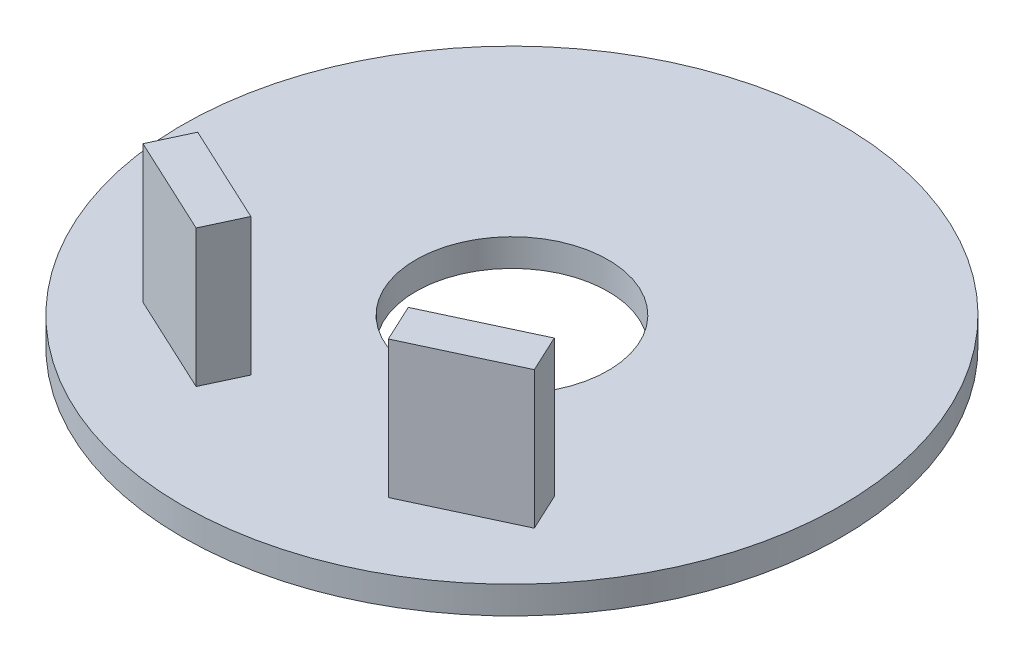
ISO-10303-21;
HEADER;
FILE_DESCRIPTION(('STEP AP214'),'2;1');
FILE_NAME('part.step','',(''),(''),'','','');
FILE_SCHEMA(('AUTOMOTIVE_DESIGN { 1 0 10303 214 1 1 1 1 }'));
ENDSEC;
DATA;
#1=APPLICATION_CONTEXT('core data for automotive mechanical design processes');
#2=APPLICATION_PROTOCOL_DEFINITION('international standard','automotive_design',2000,#1);
#3=PRODUCT_CONTEXT('',#1,'mechanical');
#4=PRODUCT('Part','Part','',(#3));
#5=PRODUCT_RELATED_PRODUCT_CATEGORY('part','',(#4));
#6=PRODUCT_DEFINITION_FORMATION('','',#4);
#7=PRODUCT_DEFINITION_CONTEXT('part definition',#1,'design');
#8=PRODUCT_DEFINITION('design','',#6,#7);
#9=PRODUCT_DEFINITION_SHAPE('','',#8);
#10=(LENGTH_UNIT() NAMED_UNIT(*) SI_UNIT(.MILLI.,.METRE.));
#11=(NAMED_UNIT(*) PLANE_ANGLE_UNIT() SI_UNIT($,.RADIAN.));
#12=(NAMED_UNIT(*) SI_UNIT($,.STERADIAN.) SOLID_ANGLE_UNIT());
#13=UNCERTAINTY_MEASURE_WITH_UNIT(LENGTH_MEASURE(1.E-05),#10,'distance_accuracy_value','');
#14=(GEOMETRIC_REPRESENTATION_CONTEXT(3) GLOBAL_UNCERTAINTY_ASSIGNED_CONTEXT((#13)) GLOBAL_UNIT_ASSIGNED_CONTEXT((#10,
#11,#12)) REPRESENTATION_CONTEXT('',''));
#15=CARTESIAN_POINT('',(0.,0.,0.));
#16=DIRECTION('',(0.,0.,1.));
#17=DIRECTION('',(1.,0.,0.));
#18=AXIS2_PLACEMENT_3D('',#15,#16,#17);
#19=CARTESIAN_POINT('',(0.,0.5,0.));
#20=DIRECTION('',(0.,1.,0.));
#21=DIRECTION('',(0.,0.,1.));
#22=AXIS2_PLACEMENT_3D('',#19,#20,#21);
#23=PLANE('',#22);
#24=CARTESIAN_POINT('',(0.,0.5,0.));
#25=DIRECTION('',(0.,1.,0.));
#26=DIRECTION('',(0.,0.,1.));
#27=AXIS2_PLACEMENT_3D('',#24,#25,#26);
#28=CIRCLE('',#27,12.);
#29=CARTESIAN_POINT('',(0.,0.5,12.));
#30=VERTEX_POINT('',#29);
#31=EDGE_CURVE('E11',#30,#30,#28,.T.);
#32=ORIENTED_EDGE('',*,*,#31,.T.);
#33=EDGE_LOOP('',(#32));
#34=FACE_BOUND('',#33,.T.);
#35=CARTESIAN_POINT('',(0.,0.5,0.));
#36=DIRECTION('',(0.,1.,0.));
#37=DIRECTION('',(0.,0.,1.));
#38=AXIS2_PLACEMENT_3D('',#35,#36,#37);
#39=CIRCLE('',#38,3.5);
#40=CARTESIAN_POINT('',(0.,0.5,3.5));
#41=VERTEX_POINT('',#40);
#42=EDGE_CURVE('E161',#41,#41,#39,.T.);
#43=ORIENTED_EDGE('',*,*,#42,.F.);
#44=EDGE_LOOP('',(#43));
#45=FACE_BOUND('',#44,.T.);
#46=DIRECTION('',(0.906307787036653,0.,0.422618261740693));
#47=VECTOR('',#46,1.);
#48=CARTESIAN_POINT('',(-3.5,0.5,8.));
#49=LINE('',#48,#47);
#50=CARTESIAN_POINT('',(-7.12523114814661,0.5,6.30952695303723));
#51=VERTEX_POINT('',#50);
#52=CARTESIAN_POINT('',(-3.5,0.5,8.));
#53=VERTEX_POINT('',#52);
#54=EDGE_CURVE('E132',#51,#53,#49,.T.);
#55=ORIENTED_EDGE('',*,*,#54,.F.);
#56=DIRECTION('',(-0.422618261740693,0.,0.906307787036653));
#57=VECTOR('',#56,1.);
#58=CARTESIAN_POINT('',(-7.12523114814661,0.5,6.30952695303723));
#59=LINE('',#58,#57);
#60=CARTESIAN_POINT('',(-6.49130375553557,0.5,4.95006527248225));
#61=VERTEX_POINT('',#60);
#62=EDGE_CURVE('E129',#61,#51,#59,.T.);
#63=ORIENTED_EDGE('',*,*,#62,.F.);
#64=DIRECTION('',(-0.906307787036653,0.,-0.422618261740693));
#65=VECTOR('',#64,1.);
#66=CARTESIAN_POINT('',(-6.49130375553557,0.5,4.95006527248225));
#67=LINE('',#66,#65);
#68=CARTESIAN_POINT('',(-2.86607260738896,0.5,6.64053831944502));
#69=VERTEX_POINT('',#68);
#70=EDGE_CURVE('E141',#69,#61,#67,.T.);
#71=ORIENTED_EDGE('',*,*,#70,.F.);
#72=DIRECTION('',(0.422618261740693,0.,-0.906307787036653));
#73=VECTOR('',#72,1.);
#74=CARTESIAN_POINT('',(-2.86607260738896,0.5,6.64053831944502));
#75=LINE('',#74,#73);
#76=EDGE_CURVE('E149',#53,#69,#75,.T.);
#77=ORIENTED_EDGE('',*,*,#76,.F.);
#78=EDGE_LOOP('',(#55,#63,#71,#77));
#79=FACE_BOUND('',#78,.T.);
#80=DIRECTION('',(-0.422618261740693,0.,-0.906307787036653));
#81=VECTOR('',#80,1.);
#82=CARTESIAN_POINT('',(7.12523114814661,0.5,6.30952695303723));
#83=LINE('',#82,#81);
#84=CARTESIAN_POINT('',(7.12523114814661,0.5,6.30952695303723));
#85=VERTEX_POINT('',#84);
#86=CARTESIAN_POINT('',(6.49130375553557,0.5,4.95006527248225));
#87=VERTEX_POINT('',#86);
#88=EDGE_CURVE('E198',#85,#87,#83,.T.);
#89=ORIENTED_EDGE('',*,*,#88,.F.);
#90=DIRECTION('',(0.906307787036653,0.,-0.422618261740693));
#91=VECTOR('',#90,1.);
#92=CARTESIAN_POINT('',(3.5,0.5,8.));
#93=LINE('',#92,#91);
#94=CARTESIAN_POINT('',(3.5,0.5,8.));
#95=VERTEX_POINT('',#94);
#96=EDGE_CURVE('E127',#95,#85,#93,.T.);
#97=ORIENTED_EDGE('',*,*,#96,.F.);
#98=DIRECTION('',(0.422618261740693,0.,0.906307787036653));
#99=VECTOR('',#98,1.);
#100=CARTESIAN_POINT('',(2.86607260738896,0.5,6.64053831944502));
#101=LINE('',#100,#99);
#102=CARTESIAN_POINT('',(2.86607260738896,0.5,6.64053831944502));
#103=VERTEX_POINT('',#102);
#104=EDGE_CURVE('E123',#103,#95,#101,.T.);
#105=ORIENTED_EDGE('',*,*,#104,.F.);
#106=DIRECTION('',(-0.906307787036653,0.,0.422618261740693));
#107=VECTOR('',#106,1.);
#108=CARTESIAN_POINT('',(6.49130375553557,0.5,4.95006527248225));
#109=LINE('',#108,#107);
#110=EDGE_CURVE('E200',#87,#103,#109,.T.);
#111=ORIENTED_EDGE('',*,*,#110,.F.);
#112=EDGE_LOOP('',(#89,#97,#105,#111));
#113=FACE_BOUND('',#112,.T.);
#114=ADVANCED_FACE('F38',(#34,#45,#79,#113),#23,.T.);
#115=CARTESIAN_POINT('',(0.,-0.5,0.));
#116=DIRECTION('',(0.,1.,0.));
#117=DIRECTION('',(0.,0.,1.));
#118=AXIS2_PLACEMENT_3D('',#115,#116,#117);
#119=PLANE('',#118);
#120=CARTESIAN_POINT('',(0.,-0.5,0.));
#121=DIRECTION('',(0.,1.,0.));
#122=DIRECTION('',(0.,0.,1.));
#123=AXIS2_PLACEMENT_3D('',#120,#121,#122);
#124=CIRCLE('',#123,12.);
#125=CARTESIAN_POINT('',(0.,-0.5,12.));
#126=VERTEX_POINT('',#125);
#127=EDGE_CURVE('E42',#126,#126,#124,.T.);
#128=ORIENTED_EDGE('',*,*,#127,.F.);
#129=EDGE_LOOP('',(#128));
#130=FACE_BOUND('',#129,.T.);
#131=CARTESIAN_POINT('',(0.,-0.5,0.));
#132=DIRECTION('',(0.,1.,0.));
#133=DIRECTION('',(0.,0.,1.));
#134=AXIS2_PLACEMENT_3D('',#131,#132,#133);
#135=CIRCLE('',#134,3.5);
#136=CARTESIAN_POINT('',(0.,-0.5,3.5));
#137=VERTEX_POINT('',#136);
#138=EDGE_CURVE('E160',#137,#137,#135,.T.);
#139=ORIENTED_EDGE('',*,*,#138,.T.);
#140=EDGE_LOOP('',(#139));
#141=FACE_BOUND('',#140,.T.);
#142=ADVANCED_FACE('F167',(#130,#141),#119,.F.);
#143=CARTESIAN_POINT('',(0.,0.5,0.));
#144=DIRECTION('',(0.,-1.,0.));
#145=DIRECTION('',(0.,0.,-1.));
#146=AXIS2_PLACEMENT_3D('',#143,#144,#145);
#147=CYLINDRICAL_SURFACE('',#146,12.);
#148=ORIENTED_EDGE('',*,*,#31,.F.);
#149=EDGE_LOOP('',(#148));
#150=FACE_BOUND('',#149,.T.);
#151=ORIENTED_EDGE('',*,*,#127,.T.);
#152=EDGE_LOOP('',(#151));
#153=FACE_BOUND('',#152,.T.);
#154=ADVANCED_FACE('F40',(#150,#153),#147,.T.);
#155=CARTESIAN_POINT('',(0.,0.5,0.));
#156=DIRECTION('',(0.,-1.,0.));
#157=DIRECTION('',(0.,0.,-1.));
#158=AXIS2_PLACEMENT_3D('',#155,#156,#157);
#159=CYLINDRICAL_SURFACE('',#158,3.5);
#160=ORIENTED_EDGE('',*,*,#42,.T.);
#161=EDGE_LOOP('',(#160));
#162=FACE_BOUND('',#161,.T.);
#163=ORIENTED_EDGE('',*,*,#138,.F.);
#164=EDGE_LOOP('',(#163));
#165=FACE_BOUND('',#164,.T.);
#166=ADVANCED_FACE('F169',(#162,#165),#159,.F.);
#167=CARTESIAN_POINT('',(-7.12523114814661,5.5,6.30952695303723));
#168=DIRECTION('',(0.906307787036653,0.,0.422618261740693));
#169=DIRECTION('',(0.422618261740693,0.,-0.906307787036653));
#170=AXIS2_PLACEMENT_3D('',#167,#168,#169);
#171=PLANE('',#170);
#172=ORIENTED_EDGE('',*,*,#62,.T.);
#173=DIRECTION('',(0.,-1.,0.));
#174=VECTOR('',#173,1.);
#175=CARTESIAN_POINT('',(-7.12523114814661,5.5,6.30952695303723));
#176=LINE('',#175,#174);
#177=CARTESIAN_POINT('',(-7.12523114814661,5.5,6.30952695303723));
#178=VERTEX_POINT('',#177);
#179=EDGE_CURVE('E158',#178,#51,#176,.T.);
#180=ORIENTED_EDGE('',*,*,#179,.F.);
#181=DIRECTION('',(-0.422618261740693,0.,0.906307787036653));
#182=VECTOR('',#181,1.);
#183=CARTESIAN_POINT('',(-7.12523114814661,5.5,6.30952695303723));
#184=LINE('',#183,#182);
#185=CARTESIAN_POINT('',(-6.49130375553557,5.5,4.95006527248225));
#186=VERTEX_POINT('',#185);
#187=EDGE_CURVE('E137',#186,#178,#184,.T.);
#188=ORIENTED_EDGE('',*,*,#187,.F.);
#189=DIRECTION('',(0.,-1.,0.));
#190=VECTOR('',#189,1.);
#191=CARTESIAN_POINT('',(-6.49130375553557,5.5,4.95006527248225));
#192=LINE('',#191,#190);
#193=EDGE_CURVE('E146',#186,#61,#192,.T.);
#194=ORIENTED_EDGE('',*,*,#193,.T.);
#195=EDGE_LOOP('',(#172,#180,#188,#194));
#196=FACE_BOUND('',#195,.T.);
#197=ADVANCED_FACE('F171',(#196),#171,.F.);
#198=CARTESIAN_POINT('',(-3.5,5.5,8.));
#199=DIRECTION('',(0.422618261740693,0.,-0.906307787036653));
#200=DIRECTION('',(-0.906307787036653,0.,-0.422618261740693));
#201=AXIS2_PLACEMENT_3D('',#198,#199,#200);
#202=PLANE('',#201);
#203=ORIENTED_EDGE('',*,*,#54,.T.);
#204=DIRECTION('',(0.,-1.,0.));
#205=VECTOR('',#204,1.);
#206=CARTESIAN_POINT('',(-3.5,5.5,8.));
#207=LINE('',#206,#205);
#208=CARTESIAN_POINT('',(-3.5,5.5,8.));
#209=VERTEX_POINT('',#208);
#210=EDGE_CURVE('E155',#209,#53,#207,.T.);
#211=ORIENTED_EDGE('',*,*,#210,.F.);
#212=DIRECTION('',(0.906307787036653,0.,0.422618261740693));
#213=VECTOR('',#212,1.);
#214=CARTESIAN_POINT('',(-3.5,5.5,8.));
#215=LINE('',#214,#213);
#216=EDGE_CURVE('E140',#178,#209,#215,.T.);
#217=ORIENTED_EDGE('',*,*,#216,.F.);
#218=ORIENTED_EDGE('',*,*,#179,.T.);
#219=EDGE_LOOP('',(#203,#211,#217,#218));
#220=FACE_BOUND('',#219,.T.);
#221=ADVANCED_FACE('F178',(#220),#202,.F.);
#222=CARTESIAN_POINT('',(-2.86607260738896,5.5,6.64053831944502));
#223=DIRECTION('',(-0.906307787036653,0.,-0.422618261740693));
#224=DIRECTION('',(-0.422618261740693,0.,0.906307787036653));
#225=AXIS2_PLACEMENT_3D('',#222,#223,#224);
#226=PLANE('',#225);
#227=ORIENTED_EDGE('',*,*,#76,.T.);
#228=DIRECTION('',(0.,-1.,0.));
#229=VECTOR('',#228,1.);
#230=CARTESIAN_POINT('',(-2.86607260738896,5.5,6.64053831944502));
#231=LINE('',#230,#229);
#232=CARTESIAN_POINT('',(-2.86607260738896,5.5,6.64053831944502));
#233=VERTEX_POINT('',#232);
#234=EDGE_CURVE('E61',#233,#69,#231,.T.);
#235=ORIENTED_EDGE('',*,*,#234,.F.);
#236=DIRECTION('',(0.422618261740693,0.,-0.906307787036653));
#237=VECTOR('',#236,1.);
#238=CARTESIAN_POINT('',(-2.86607260738896,5.5,6.64053831944502));
#239=LINE('',#238,#237);
#240=EDGE_CURVE('E143',#209,#233,#239,.T.);
#241=ORIENTED_EDGE('',*,*,#240,.F.);
#242=ORIENTED_EDGE('',*,*,#210,.T.);
#243=EDGE_LOOP('',(#227,#235,#241,#242));
#244=FACE_BOUND('',#243,.T.);
#245=ADVANCED_FACE('F232',(#244),#226,.F.);
#246=CARTESIAN_POINT('',(-6.49130375553557,5.5,4.95006527248225));
#247=DIRECTION('',(-0.422618261740693,0.,0.906307787036653));
#248=DIRECTION('',(0.906307787036653,0.,0.422618261740693));
#249=AXIS2_PLACEMENT_3D('',#246,#247,#248);
#250=PLANE('',#249);
#251=ORIENTED_EDGE('',*,*,#70,.T.);
#252=ORIENTED_EDGE('',*,*,#193,.F.);
#253=DIRECTION('',(-0.906307787036653,0.,-0.422618261740693));
#254=VECTOR('',#253,1.);
#255=CARTESIAN_POINT('',(-6.49130375553557,5.5,4.95006527248225));
#256=LINE('',#255,#254);
#257=EDGE_CURVE('E145',#233,#186,#256,.T.);
#258=ORIENTED_EDGE('',*,*,#257,.F.);
#259=ORIENTED_EDGE('',*,*,#234,.T.);
#260=EDGE_LOOP('',(#251,#252,#258,#259));
#261=FACE_BOUND('',#260,.T.);
#262=ADVANCED_FACE('F228',(#261),#250,.F.);
#263=CARTESIAN_POINT('',(0.,5.5,0.));
#264=DIRECTION('',(0.,-1.,0.));
#265=DIRECTION('',(0.,0.,-1.));
#266=AXIS2_PLACEMENT_3D('',#263,#264,#265);
#267=PLANE('',#266);
#268=ORIENTED_EDGE('',*,*,#187,.T.);
#269=ORIENTED_EDGE('',*,*,#216,.T.);
#270=ORIENTED_EDGE('',*,*,#240,.T.);
#271=ORIENTED_EDGE('',*,*,#257,.T.);
#272=EDGE_LOOP('',(#268,#269,#270,#271));
#273=FACE_BOUND('',#272,.T.);
#274=ADVANCED_FACE('F225',(#273),#267,.F.);
#275=CARTESIAN_POINT('',(3.5,5.5,8.));
#276=DIRECTION('',(-0.422618261740693,0.,-0.906307787036653));
#277=DIRECTION('',(-0.906307787036653,0.,0.422618261740693));
#278=AXIS2_PLACEMENT_3D('',#275,#276,#277);
#279=PLANE('',#278);
#280=ORIENTED_EDGE('',*,*,#96,.T.);
#281=DIRECTION('',(0.,-1.,0.));
#282=VECTOR('',#281,1.);
#283=CARTESIAN_POINT('',(7.12523114814661,5.5,6.30952695303723));
#284=LINE('',#283,#282);
#285=CARTESIAN_POINT('',(7.12523114814661,5.5,6.30952695303723));
#286=VERTEX_POINT('',#285);
#287=EDGE_CURVE('E108',#286,#85,#284,.T.);
#288=ORIENTED_EDGE('',*,*,#287,.F.);
#289=DIRECTION('',(0.906307787036653,0.,-0.422618261740693));
#290=VECTOR('',#289,1.);
#291=CARTESIAN_POINT('',(3.5,5.5,8.));
#292=LINE('',#291,#290);
#293=CARTESIAN_POINT('',(3.5,5.5,8.));
#294=VERTEX_POINT('',#293);
#295=EDGE_CURVE('E115',#294,#286,#292,.T.);
#296=ORIENTED_EDGE('',*,*,#295,.F.);
#297=DIRECTION('',(0.,-1.,0.));
#298=VECTOR('',#297,1.);
#299=CARTESIAN_POINT('',(3.5,5.5,8.));
#300=LINE('',#299,#298);
#301=EDGE_CURVE('E207',#294,#95,#300,.T.);
#302=ORIENTED_EDGE('',*,*,#301,.T.);
#303=EDGE_LOOP('',(#280,#288,#296,#302));
#304=FACE_BOUND('',#303,.T.);
#305=ADVANCED_FACE('F125',(#304),#279,.F.);
#306=CARTESIAN_POINT('',(7.12523114814661,5.5,6.30952695303723));
#307=DIRECTION('',(-0.906307787036653,0.,0.422618261740693));
#308=DIRECTION('',(0.422618261740693,0.,0.906307787036653));
#309=AXIS2_PLACEMENT_3D('',#306,#307,#308);
#310=PLANE('',#309);
#311=ORIENTED_EDGE('',*,*,#88,.T.);
#312=DIRECTION('',(0.,-1.,0.));
#313=VECTOR('',#312,1.);
#314=CARTESIAN_POINT('',(6.49130375553557,5.5,4.95006527248225));
#315=LINE('',#314,#313);
#316=CARTESIAN_POINT('',(6.49130375553557,5.5,4.95006527248225));
#317=VERTEX_POINT('',#316);
#318=EDGE_CURVE('E111',#317,#87,#315,.T.);
#319=ORIENTED_EDGE('',*,*,#318,.F.);
#320=DIRECTION('',(-0.422618261740693,0.,-0.906307787036653));
#321=VECTOR('',#320,1.);
#322=CARTESIAN_POINT('',(7.12523114814661,5.5,6.30952695303723));
#323=LINE('',#322,#321);
#324=EDGE_CURVE('E104',#286,#317,#323,.T.);
#325=ORIENTED_EDGE('',*,*,#324,.F.);
#326=ORIENTED_EDGE('',*,*,#287,.T.);
#327=EDGE_LOOP('',(#311,#319,#325,#326));
#328=FACE_BOUND('',#327,.T.);
#329=ADVANCED_FACE('F106',(#328),#310,.F.);
#330=CARTESIAN_POINT('',(6.49130375553557,5.5,4.95006527248225));
#331=DIRECTION('',(0.422618261740693,0.,0.906307787036653));
#332=DIRECTION('',(0.906307787036653,0.,-0.422618261740693));
#333=AXIS2_PLACEMENT_3D('',#330,#331,#332);
#334=PLANE('',#333);
#335=ORIENTED_EDGE('',*,*,#110,.T.);
#336=DIRECTION('',(0.,-1.,0.));
#337=VECTOR('',#336,1.);
#338=CARTESIAN_POINT('',(2.86607260738896,5.5,6.64053831944502));
#339=LINE('',#338,#337);
#340=CARTESIAN_POINT('',(2.86607260738896,5.5,6.64053831944502));
#341=VERTEX_POINT('',#340);
#342=EDGE_CURVE('E53',#341,#103,#339,.T.);
#343=ORIENTED_EDGE('',*,*,#342,.F.);
#344=DIRECTION('',(-0.906307787036653,0.,0.422618261740693));
#345=VECTOR('',#344,1.);
#346=CARTESIAN_POINT('',(6.49130375553557,5.5,4.95006527248225));
#347=LINE('',#346,#345);
#348=EDGE_CURVE('E114',#317,#341,#347,.T.);
#349=ORIENTED_EDGE('',*,*,#348,.F.);
#350=ORIENTED_EDGE('',*,*,#318,.T.);
#351=EDGE_LOOP('',(#335,#343,#349,#350));
#352=FACE_BOUND('',#351,.T.);
#353=ADVANCED_FACE('F210',(#352),#334,.F.);
#354=CARTESIAN_POINT('',(2.86607260738896,5.5,6.64053831944502));
#355=DIRECTION('',(0.906307787036653,0.,-0.422618261740693));
#356=DIRECTION('',(-0.422618261740693,0.,-0.906307787036653));
#357=AXIS2_PLACEMENT_3D('',#354,#355,#356);
#358=PLANE('',#357);
#359=ORIENTED_EDGE('',*,*,#104,.T.);
#360=ORIENTED_EDGE('',*,*,#301,.F.);
#361=DIRECTION('',(0.422618261740693,0.,0.906307787036653));
#362=VECTOR('',#361,1.);
#363=CARTESIAN_POINT('',(2.86607260738896,5.5,6.64053831944502));
#364=LINE('',#363,#362);
#365=EDGE_CURVE('E119',#341,#294,#364,.T.);
#366=ORIENTED_EDGE('',*,*,#365,.F.);
#367=ORIENTED_EDGE('',*,*,#342,.T.);
#368=EDGE_LOOP('',(#359,#360,#366,#367));
#369=FACE_BOUND('',#368,.T.);
#370=ADVANCED_FACE('F211',(#369),#358,.F.);
#371=CARTESIAN_POINT('',(0.,5.5,0.));
#372=DIRECTION('',(0.,1.,0.));
#373=DIRECTION('',(0.,0.,1.));
#374=AXIS2_PLACEMENT_3D('',#371,#372,#373);
#375=PLANE('',#374);
#376=ORIENTED_EDGE('',*,*,#295,.T.);
#377=ORIENTED_EDGE('',*,*,#324,.T.);
#378=ORIENTED_EDGE('',*,*,#348,.T.);
#379=ORIENTED_EDGE('',*,*,#365,.T.);
#380=EDGE_LOOP('',(#376,#377,#378,#379));
#381=FACE_BOUND('',#380,.T.);
#382=ADVANCED_FACE('F118',(#381),#375,.T.);
#383=CLOSED_SHELL('',(#114,#142,#154,#166,#197,#221,#245,#262,#274,#305,#329,#353,#370,#382));
#384=MANIFOLD_SOLID_BREP('B2',#383);
#385=ADVANCED_BREP_SHAPE_REPRESENTATION('',(#18,#384),#14);
#386=SHAPE_DEFINITION_REPRESENTATION(#9,#385);
ENDSEC;
END-ISO-10303-21;
